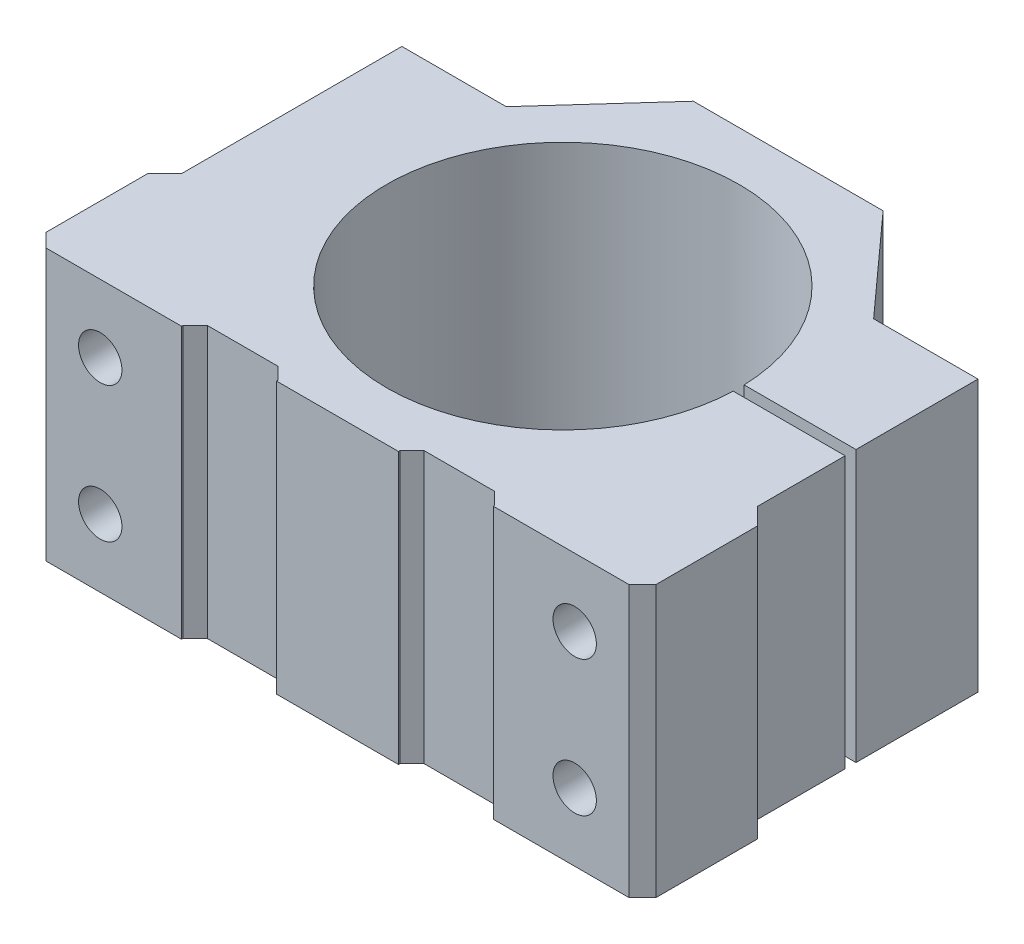
ISO-10303-21;
HEADER;
FILE_DESCRIPTION(('STEP AP214'),'2;1');
FILE_NAME('part.step','',(''),(''),'','','');
FILE_SCHEMA(('AUTOMOTIVE_DESIGN { 1 0 10303 214 1 1 1 1 }'));
ENDSEC;
DATA;
#1=APPLICATION_CONTEXT('core data for automotive mechanical design processes');
#2=APPLICATION_PROTOCOL_DEFINITION('international standard','automotive_design',2000,#1);
#3=PRODUCT_CONTEXT('',#1,'mechanical');
#4=PRODUCT('Part','Part','',(#3));
#5=PRODUCT_RELATED_PRODUCT_CATEGORY('part','',(#4));
#6=PRODUCT_DEFINITION_FORMATION('','',#4);
#7=PRODUCT_DEFINITION_CONTEXT('part definition',#1,'design');
#8=PRODUCT_DEFINITION('design','',#6,#7);
#9=PRODUCT_DEFINITION_SHAPE('','',#8);
#10=(LENGTH_UNIT() NAMED_UNIT(*) SI_UNIT(.MILLI.,.METRE.));
#11=(NAMED_UNIT(*) PLANE_ANGLE_UNIT() SI_UNIT($,.RADIAN.));
#12=(NAMED_UNIT(*) SI_UNIT($,.STERADIAN.) SOLID_ANGLE_UNIT());
#13=UNCERTAINTY_MEASURE_WITH_UNIT(LENGTH_MEASURE(1.E-05),#10,'distance_accuracy_value','');
#14=(GEOMETRIC_REPRESENTATION_CONTEXT(3) GLOBAL_UNCERTAINTY_ASSIGNED_CONTEXT((#13)) GLOBAL_UNIT_ASSIGNED_CONTEXT((#10,
#11,#12)) REPRESENTATION_CONTEXT('',''));
#15=CARTESIAN_POINT('',(0.,0.,0.));
#16=DIRECTION('',(0.,0.,1.));
#17=DIRECTION('',(1.,0.,0.));
#18=AXIS2_PLACEMENT_3D('',#15,#16,#17);
#19=CARTESIAN_POINT('',(42.5,40.,-18.75));
#20=DIRECTION('',(-1.,0.,0.));
#21=DIRECTION('',(0.,0.,1.));
#22=AXIS2_PLACEMENT_3D('',#19,#20,#21);
#23=PLANE('',#22);
#24=DIRECTION('',(0.,0.,-1.));
#25=VECTOR('',#24,1.);
#26=CARTESIAN_POINT('',(42.5,0.,-18.75));
#27=LINE('',#26,#25);
#28=CARTESIAN_POINT('',(42.5,0.,13.75));
#29=VERTEX_POINT('',#28);
#30=CARTESIAN_POINT('',(42.5,0.,0.849999999999967));
#31=VERTEX_POINT('',#30);
#32=EDGE_CURVE('E358',#29,#31,#27,.T.);
#33=ORIENTED_EDGE('',*,*,#32,.T.);
#34=DIRECTION('',(0.,-1.,0.));
#35=VECTOR('',#34,1.);
#36=CARTESIAN_POINT('',(42.5,0.,0.849999999999967));
#37=LINE('',#36,#35);
#38=CARTESIAN_POINT('',(42.5,40.,0.849999999999968));
#39=VERTEX_POINT('',#38);
#40=EDGE_CURVE('E490',#39,#31,#37,.T.);
#41=ORIENTED_EDGE('',*,*,#40,.F.);
#42=DIRECTION('',(0.,0.,-1.));
#43=VECTOR('',#42,1.);
#44=CARTESIAN_POINT('',(42.5,40.,-18.75));
#45=LINE('',#44,#43);
#46=CARTESIAN_POINT('',(42.5,40.,13.75));
#47=VERTEX_POINT('',#46);
#48=EDGE_CURVE('E304',#47,#39,#45,.T.);
#49=ORIENTED_EDGE('',*,*,#48,.F.);
#50=DIRECTION('',(0.,-1.,0.));
#51=VECTOR('',#50,1.);
#52=CARTESIAN_POINT('',(42.5,40.,13.75));
#53=LINE('',#52,#51);
#54=EDGE_CURVE('E382',#47,#29,#53,.T.);
#55=ORIENTED_EDGE('',*,*,#54,.T.);
#56=EDGE_LOOP('',(#33,#41,#49,#55));
#57=FACE_BOUND('',#56,.T.);
#58=ADVANCED_FACE('F32',(#57),#23,.F.);
#59=CARTESIAN_POINT('',(35.,30.,33.25));
#60=DIRECTION('',(0.,0.,-1.));
#61=DIRECTION('',(-1.,0.,0.));
#62=AXIS2_PLACEMENT_3D('',#59,#60,#61);
#63=CYLINDRICAL_SURFACE('',#62,3.2);
#64=CARTESIAN_POINT('',(35.,30.,0.849999999999969));
#65=DIRECTION('',(0.,0.,1.));
#66=DIRECTION('',(1.,0.,0.));
#67=AXIS2_PLACEMENT_3D('',#64,#65,#66);
#68=CIRCLE('',#67,3.2);
#69=CARTESIAN_POINT('',(38.2,30.,0.849999999999967));
#70=VERTEX_POINT('',#69);
#71=EDGE_CURVE('E503',#70,#70,#68,.T.);
#72=ORIENTED_EDGE('',*,*,#71,.F.);
#73=EDGE_LOOP('',(#72));
#74=FACE_BOUND('',#73,.T.);
#75=CARTESIAN_POINT('',(35.,30.,33.25));
#76=DIRECTION('',(0.,0.,-1.));
#77=DIRECTION('',(-1.,0.,0.));
#78=AXIS2_PLACEMENT_3D('',#75,#76,#77);
#79=CIRCLE('',#78,3.2);
#80=CARTESIAN_POINT('',(31.8,30.,33.25));
#81=VERTEX_POINT('',#80);
#82=EDGE_CURVE('E256',#81,#81,#79,.T.);
#83=ORIENTED_EDGE('',*,*,#82,.F.);
#84=EDGE_LOOP('',(#83));
#85=FACE_BOUND('',#84,.T.);
#86=ADVANCED_FACE('F527',(#74,#85),#63,.F.);
#87=CARTESIAN_POINT('',(35.,10.,33.25));
#88=DIRECTION('',(0.,0.,-1.));
#89=DIRECTION('',(-1.,0.,0.));
#90=AXIS2_PLACEMENT_3D('',#87,#88,#89);
#91=CYLINDRICAL_SURFACE('',#90,3.2);
#92=CARTESIAN_POINT('',(35.,10.,0.849999999999969));
#93=DIRECTION('',(0.,0.,1.));
#94=DIRECTION('',(1.,0.,0.));
#95=AXIS2_PLACEMENT_3D('',#92,#93,#94);
#96=CIRCLE('',#95,3.2);
#97=CARTESIAN_POINT('',(38.2,10.,0.849999999999967));
#98=VERTEX_POINT('',#97);
#99=EDGE_CURVE('E247',#98,#98,#96,.T.);
#100=ORIENTED_EDGE('',*,*,#99,.F.);
#101=EDGE_LOOP('',(#100));
#102=FACE_BOUND('',#101,.T.);
#103=CARTESIAN_POINT('',(35.,10.,33.25));
#104=DIRECTION('',(0.,0.,-1.));
#105=DIRECTION('',(-1.,0.,0.));
#106=AXIS2_PLACEMENT_3D('',#103,#104,#105);
#107=CIRCLE('',#106,3.2);
#108=CARTESIAN_POINT('',(31.8,10.,33.25));
#109=VERTEX_POINT('',#108);
#110=EDGE_CURVE('E507',#109,#109,#107,.T.);
#111=ORIENTED_EDGE('',*,*,#110,.F.);
#112=EDGE_LOOP('',(#111));
#113=FACE_BOUND('',#112,.T.);
#114=ADVANCED_FACE('F529',(#102,#113),#91,.F.);
#115=CARTESIAN_POINT('',(0.,40.,0.));
#116=DIRECTION('',(0.,-1.,0.));
#117=DIRECTION('',(0.,0.,-1.));
#118=AXIS2_PLACEMENT_3D('',#115,#116,#117);
#119=PLANE('',#118);
#120=ORIENTED_EDGE('',*,*,#48,.T.);
#121=DIRECTION('',(1.,0.,0.));
#122=VECTOR('',#121,1.);
#123=CARTESIAN_POINT('',(-45.001,40.,0.850000000000006));
#124=LINE('',#123,#122);
#125=CARTESIAN_POINT('',(25.9861020547523,40.,0.849999999999975));
#126=VERTEX_POINT('',#125);
#127=EDGE_CURVE('E498',#126,#39,#124,.T.);
#128=ORIENTED_EDGE('',*,*,#127,.F.);
#129=CARTESIAN_POINT('',(0.,40.,0.));
#130=DIRECTION('',(0.,1.,0.));
#131=DIRECTION('',(0.,0.,1.));
#132=AXIS2_PLACEMENT_3D('',#129,#130,#131);
#133=CIRCLE('',#132,26.);
#134=CARTESIAN_POINT('',(25.9891804410989,40.,-0.750000000000025));
#135=VERTEX_POINT('',#134);
#136=EDGE_CURVE('E250',#135,#126,#133,.T.);
#137=ORIENTED_EDGE('',*,*,#136,.F.);
#138=DIRECTION('',(1.,0.,0.));
#139=VECTOR('',#138,1.);
#140=CARTESIAN_POINT('',(-45.001,40.,-0.749999999999995));
#141=LINE('',#140,#139);
#142=CARTESIAN_POINT('',(42.5,40.,-0.750000000000033));
#143=VERTEX_POINT('',#142);
#144=EDGE_CURVE('E57',#135,#143,#141,.T.);
#145=ORIENTED_EDGE('',*,*,#144,.T.);
#146=CARTESIAN_POINT('',(42.5,40.,-18.75));
#147=VERTEX_POINT('',#146);
#148=EDGE_CURVE('E303',#143,#147,#45,.T.);
#149=ORIENTED_EDGE('',*,*,#148,.T.);
#150=DIRECTION('',(-1.,0.,0.));
#151=VECTOR('',#150,1.);
#152=CARTESIAN_POINT('',(42.5,40.,-18.75));
#153=LINE('',#152,#151);
#154=CARTESIAN_POINT('',(27.1,40.,-18.75));
#155=VERTEX_POINT('',#154);
#156=EDGE_CURVE('E307',#147,#155,#153,.T.);
#157=ORIENTED_EDGE('',*,*,#156,.T.);
#158=DIRECTION('',(-0.670377163466849,0.,-0.742020524448038));
#159=VECTOR('',#158,1.);
#160=CARTESIAN_POINT('',(27.1,40.,-18.75));
#161=LINE('',#160,#159);
#162=CARTESIAN_POINT('',(13.9999999999999,40.,-33.25));
#163=VERTEX_POINT('',#162);
#164=EDGE_CURVE('E309',#155,#163,#161,.T.);
#165=ORIENTED_EDGE('',*,*,#164,.T.);
#166=DIRECTION('',(-1.,0.,0.));
#167=VECTOR('',#166,1.);
#168=CARTESIAN_POINT('',(-14.,40.,-33.25));
#169=LINE('',#168,#167);
#170=CARTESIAN_POINT('',(-14.,40.,-33.25));
#171=VERTEX_POINT('',#170);
#172=EDGE_CURVE('E311',#163,#171,#169,.T.);
#173=ORIENTED_EDGE('',*,*,#172,.T.);
#174=DIRECTION('',(-0.670377163466849,0.,0.742020524448039));
#175=VECTOR('',#174,1.);
#176=CARTESIAN_POINT('',(-27.1,40.,-18.75));
#177=LINE('',#176,#175);
#178=CARTESIAN_POINT('',(-27.1,40.,-18.75));
#179=VERTEX_POINT('',#178);
#180=EDGE_CURVE('E313',#171,#179,#177,.T.);
#181=ORIENTED_EDGE('',*,*,#180,.T.);
#182=DIRECTION('',(-1.,0.,0.));
#183=VECTOR('',#182,1.);
#184=CARTESIAN_POINT('',(-42.5,40.,-18.75));
#185=LINE('',#184,#183);
#186=CARTESIAN_POINT('',(-42.5,40.,-18.75));
#187=VERTEX_POINT('',#186);
#188=EDGE_CURVE('E259',#179,#187,#185,.T.);
#189=ORIENTED_EDGE('',*,*,#188,.T.);
#190=DIRECTION('',(0.,0.,1.));
#191=VECTOR('',#190,1.);
#192=CARTESIAN_POINT('',(-42.5,40.,-18.75));
#193=LINE('',#192,#191);
#194=CARTESIAN_POINT('',(-42.5,40.,13.75));
#195=VERTEX_POINT('',#194);
#196=EDGE_CURVE('E262',#187,#195,#193,.T.);
#197=ORIENTED_EDGE('',*,*,#196,.T.);
#198=DIRECTION('',(-0.707106781186549,0.,0.707106781186545));
#199=VECTOR('',#198,1.);
#200=CARTESIAN_POINT('',(-42.5,40.,13.75));
#201=LINE('',#200,#199);
#202=CARTESIAN_POINT('',(-45.,40.,16.25));
#203=VERTEX_POINT('',#202);
#204=EDGE_CURVE('E265',#195,#203,#201,.T.);
#205=ORIENTED_EDGE('',*,*,#204,.T.);
#206=DIRECTION('',(0.,0.,1.));
#207=VECTOR('',#206,1.);
#208=CARTESIAN_POINT('',(-45.,40.,31.25));
#209=LINE('',#208,#207);
#210=CARTESIAN_POINT('',(-45.,40.,31.25));
#211=VERTEX_POINT('',#210);
#212=EDGE_CURVE('E267',#203,#211,#209,.T.);
#213=ORIENTED_EDGE('',*,*,#212,.T.);
#214=DIRECTION('',(0.707106781186547,0.,0.707106781186547));
#215=VECTOR('',#214,1.);
#216=CARTESIAN_POINT('',(-43.,40.,33.25));
#217=LINE('',#216,#215);
#218=CARTESIAN_POINT('',(-43.,40.,33.25));
#219=VERTEX_POINT('',#218);
#220=EDGE_CURVE('E269',#211,#219,#217,.T.);
#221=ORIENTED_EDGE('',*,*,#220,.T.);
#222=DIRECTION('',(1.,0.,0.));
#223=VECTOR('',#222,1.);
#224=CARTESIAN_POINT('',(-43.,40.,33.25));
#225=LINE('',#224,#223);
#226=CARTESIAN_POINT('',(-23.,40.,33.25));
#227=VERTEX_POINT('',#226);
#228=EDGE_CURVE('E271',#219,#227,#225,.T.);
#229=ORIENTED_EDGE('',*,*,#228,.T.);
#230=DIRECTION('',(0.,0.,-1.));
#231=VECTOR('',#230,1.);
#232=CARTESIAN_POINT('',(-23.,40.,33.25));
#233=LINE('',#232,#231);
#234=CARTESIAN_POINT('',(-23.,40.,33.05));
#235=VERTEX_POINT('',#234);
#236=EDGE_CURVE('E273',#227,#235,#233,.T.);
#237=ORIENTED_EDGE('',*,*,#236,.T.);
#238=DIRECTION('',(0.707106781186547,0.,-0.707106781186548));
#239=VECTOR('',#238,1.);
#240=CARTESIAN_POINT('',(-21.2,40.,31.25));
#241=LINE('',#240,#239);
#242=CARTESIAN_POINT('',(-21.2,40.,31.25));
#243=VERTEX_POINT('',#242);
#244=EDGE_CURVE('E275',#235,#243,#241,.T.);
#245=ORIENTED_EDGE('',*,*,#244,.T.);
#246=DIRECTION('',(1.,0.,0.));
#247=VECTOR('',#246,1.);
#248=CARTESIAN_POINT('',(-10.8,40.,31.25));
#249=LINE('',#248,#247);
#250=CARTESIAN_POINT('',(-10.8,40.,31.25));
#251=VERTEX_POINT('',#250);
#252=EDGE_CURVE('E277',#243,#251,#249,.T.);
#253=ORIENTED_EDGE('',*,*,#252,.T.);
#254=DIRECTION('',(0.707106781186547,0.,0.707106781186548));
#255=VECTOR('',#254,1.);
#256=CARTESIAN_POINT('',(-8.99999999999999,40.,33.05));
#257=LINE('',#256,#255);
#258=CARTESIAN_POINT('',(-8.99999999999999,40.,33.05));
#259=VERTEX_POINT('',#258);
#260=EDGE_CURVE('E279',#251,#259,#257,.T.);
#261=ORIENTED_EDGE('',*,*,#260,.T.);
#262=DIRECTION('',(0.,0.,1.));
#263=VECTOR('',#262,1.);
#264=CARTESIAN_POINT('',(-8.99999999999999,40.,33.25));
#265=LINE('',#264,#263);
#266=CARTESIAN_POINT('',(-8.99999999999999,40.,33.25));
#267=VERTEX_POINT('',#266);
#268=EDGE_CURVE('E281',#259,#267,#265,.T.);
#269=ORIENTED_EDGE('',*,*,#268,.T.);
#270=DIRECTION('',(1.,0.,0.));
#271=VECTOR('',#270,1.);
#272=CARTESIAN_POINT('',(8.99999999999999,40.,33.25));
#273=LINE('',#272,#271);
#274=CARTESIAN_POINT('',(8.99999999999999,40.,33.25));
#275=VERTEX_POINT('',#274);
#276=EDGE_CURVE('E283',#267,#275,#273,.T.);
#277=ORIENTED_EDGE('',*,*,#276,.T.);
#278=DIRECTION('',(0.,0.,-1.));
#279=VECTOR('',#278,1.);
#280=CARTESIAN_POINT('',(8.99999999999999,40.,33.05));
#281=LINE('',#280,#279);
#282=CARTESIAN_POINT('',(8.99999999999999,40.,33.05));
#283=VERTEX_POINT('',#282);
#284=EDGE_CURVE('E285',#275,#283,#281,.T.);
#285=ORIENTED_EDGE('',*,*,#284,.T.);
#286=DIRECTION('',(0.707106781186546,0.,-0.707106781186549));
#287=VECTOR('',#286,1.);
#288=CARTESIAN_POINT('',(8.99999999999999,40.,33.05));
#289=LINE('',#288,#287);
#290=CARTESIAN_POINT('',(10.8,40.,31.25));
#291=VERTEX_POINT('',#290);
#292=EDGE_CURVE('E287',#283,#291,#289,.T.);
#293=ORIENTED_EDGE('',*,*,#292,.T.);
#294=DIRECTION('',(1.,0.,0.));
#295=VECTOR('',#294,1.);
#296=CARTESIAN_POINT('',(10.8,40.,31.25));
#297=LINE('',#296,#295);
#298=CARTESIAN_POINT('',(21.2,40.,31.25));
#299=VERTEX_POINT('',#298);
#300=EDGE_CURVE('E289',#291,#299,#297,.T.);
#301=ORIENTED_EDGE('',*,*,#300,.T.);
#302=DIRECTION('',(0.707106781186547,0.,0.707106781186548));
#303=VECTOR('',#302,1.);
#304=CARTESIAN_POINT('',(21.2,40.,31.25));
#305=LINE('',#304,#303);
#306=CARTESIAN_POINT('',(23.,40.,33.05));
#307=VERTEX_POINT('',#306);
#308=EDGE_CURVE('E291',#299,#307,#305,.T.);
#309=ORIENTED_EDGE('',*,*,#308,.T.);
#310=DIRECTION('',(0.,0.,1.));
#311=VECTOR('',#310,1.);
#312=CARTESIAN_POINT('',(23.,40.,33.05));
#313=LINE('',#312,#311);
#314=CARTESIAN_POINT('',(23.,40.,33.25));
#315=VERTEX_POINT('',#314);
#316=EDGE_CURVE('E293',#307,#315,#313,.T.);
#317=ORIENTED_EDGE('',*,*,#316,.T.);
#318=DIRECTION('',(1.,0.,0.));
#319=VECTOR('',#318,1.);
#320=CARTESIAN_POINT('',(43.,40.,33.25));
#321=LINE('',#320,#319);
#322=CARTESIAN_POINT('',(43.,40.,33.25));
#323=VERTEX_POINT('',#322);
#324=EDGE_CURVE('E295',#315,#323,#321,.T.);
#325=ORIENTED_EDGE('',*,*,#324,.T.);
#326=DIRECTION('',(0.707106781186547,0.,-0.707106781186547));
#327=VECTOR('',#326,1.);
#328=CARTESIAN_POINT('',(43.,40.,33.25));
#329=LINE('',#328,#327);
#330=CARTESIAN_POINT('',(45.,40.,31.25));
#331=VERTEX_POINT('',#330);
#332=EDGE_CURVE('E297',#323,#331,#329,.T.);
#333=ORIENTED_EDGE('',*,*,#332,.T.);
#334=DIRECTION('',(0.,0.,-1.));
#335=VECTOR('',#334,1.);
#336=CARTESIAN_POINT('',(45.,40.,31.25));
#337=LINE('',#336,#335);
#338=CARTESIAN_POINT('',(45.,40.,16.25));
#339=VERTEX_POINT('',#338);
#340=EDGE_CURVE('E299',#331,#339,#337,.T.);
#341=ORIENTED_EDGE('',*,*,#340,.T.);
#342=DIRECTION('',(-0.707106781186551,0.,-0.707106781186544));
#343=VECTOR('',#342,1.);
#344=CARTESIAN_POINT('',(42.5,40.,13.75));
#345=LINE('',#344,#343);
#346=EDGE_CURVE('E301',#339,#47,#345,.T.);
#347=ORIENTED_EDGE('',*,*,#346,.T.);
#348=EDGE_LOOP('',(#120,#128,#137,#145,#149,#157,#165,#173,#181,#189,#197,#205,#213,#221,#229,
#237,#245,#253,#261,#269,#277,#285,#293,#301,#309,#317,#325,#333,#341,#347));
#349=FACE_BOUND('',#348,.T.);
#350=ADVANCED_FACE('F461',(#349),#119,.F.);
#351=CARTESIAN_POINT('',(0.,0.,0.));
#352=DIRECTION('',(0.,-1.,0.));
#353=DIRECTION('',(0.,0.,-1.));
#354=AXIS2_PLACEMENT_3D('',#351,#352,#353);
#355=PLANE('',#354);
#356=DIRECTION('',(1.,0.,0.));
#357=VECTOR('',#356,1.);
#358=CARTESIAN_POINT('',(-45.001,0.,0.850000000000005));
#359=LINE('',#358,#357);
#360=CARTESIAN_POINT('',(25.9861020547523,0.,0.849999999999974));
#361=VERTEX_POINT('',#360);
#362=EDGE_CURVE('E49',#361,#31,#359,.T.);
#363=ORIENTED_EDGE('',*,*,#362,.T.);
#364=ORIENTED_EDGE('',*,*,#32,.F.);
#365=DIRECTION('',(-0.707106781186551,0.,-0.707106781186544));
#366=VECTOR('',#365,1.);
#367=CARTESIAN_POINT('',(42.5,0.,13.75));
#368=LINE('',#367,#366);
#369=CARTESIAN_POINT('',(45.,0.,16.25));
#370=VERTEX_POINT('',#369);
#371=EDGE_CURVE('E356',#370,#29,#368,.T.);
#372=ORIENTED_EDGE('',*,*,#371,.F.);
#373=DIRECTION('',(0.,0.,-1.));
#374=VECTOR('',#373,1.);
#375=CARTESIAN_POINT('',(45.,0.,31.25));
#376=LINE('',#375,#374);
#377=CARTESIAN_POINT('',(45.,0.,31.25));
#378=VERTEX_POINT('',#377);
#379=EDGE_CURVE('E354',#378,#370,#376,.T.);
#380=ORIENTED_EDGE('',*,*,#379,.F.);
#381=DIRECTION('',(0.707106781186547,0.,-0.707106781186547));
#382=VECTOR('',#381,1.);
#383=CARTESIAN_POINT('',(43.,0.,33.25));
#384=LINE('',#383,#382);
#385=CARTESIAN_POINT('',(43.,0.,33.25));
#386=VERTEX_POINT('',#385);
#387=EDGE_CURVE('E352',#386,#378,#384,.T.);
#388=ORIENTED_EDGE('',*,*,#387,.F.);
#389=DIRECTION('',(1.,0.,0.));
#390=VECTOR('',#389,1.);
#391=CARTESIAN_POINT('',(43.,0.,33.25));
#392=LINE('',#391,#390);
#393=CARTESIAN_POINT('',(23.,0.,33.25));
#394=VERTEX_POINT('',#393);
#395=EDGE_CURVE('E350',#394,#386,#392,.T.);
#396=ORIENTED_EDGE('',*,*,#395,.F.);
#397=DIRECTION('',(0.,0.,1.));
#398=VECTOR('',#397,1.);
#399=CARTESIAN_POINT('',(23.,0.,33.05));
#400=LINE('',#399,#398);
#401=CARTESIAN_POINT('',(23.,0.,33.05));
#402=VERTEX_POINT('',#401);
#403=EDGE_CURVE('E348',#402,#394,#400,.T.);
#404=ORIENTED_EDGE('',*,*,#403,.F.);
#405=DIRECTION('',(0.707106781186547,0.,0.707106781186548));
#406=VECTOR('',#405,1.);
#407=CARTESIAN_POINT('',(21.2,0.,31.25));
#408=LINE('',#407,#406);
#409=CARTESIAN_POINT('',(21.2,0.,31.25));
#410=VERTEX_POINT('',#409);
#411=EDGE_CURVE('E346',#410,#402,#408,.T.);
#412=ORIENTED_EDGE('',*,*,#411,.F.);
#413=DIRECTION('',(1.,0.,0.));
#414=VECTOR('',#413,1.);
#415=CARTESIAN_POINT('',(10.8,0.,31.25));
#416=LINE('',#415,#414);
#417=CARTESIAN_POINT('',(10.8,0.,31.25));
#418=VERTEX_POINT('',#417);
#419=EDGE_CURVE('E344',#418,#410,#416,.T.);
#420=ORIENTED_EDGE('',*,*,#419,.F.);
#421=DIRECTION('',(0.707106781186546,0.,-0.707106781186549));
#422=VECTOR('',#421,1.);
#423=CARTESIAN_POINT('',(8.99999999999999,0.,33.05));
#424=LINE('',#423,#422);
#425=CARTESIAN_POINT('',(8.99999999999999,0.,33.05));
#426=VERTEX_POINT('',#425);
#427=EDGE_CURVE('E342',#426,#418,#424,.T.);
#428=ORIENTED_EDGE('',*,*,#427,.F.);
#429=DIRECTION('',(0.,0.,-1.));
#430=VECTOR('',#429,1.);
#431=CARTESIAN_POINT('',(8.99999999999999,0.,33.05));
#432=LINE('',#431,#430);
#433=CARTESIAN_POINT('',(8.99999999999999,0.,33.25));
#434=VERTEX_POINT('',#433);
#435=EDGE_CURVE('E340',#434,#426,#432,.T.);
#436=ORIENTED_EDGE('',*,*,#435,.F.);
#437=DIRECTION('',(1.,0.,0.));
#438=VECTOR('',#437,1.);
#439=CARTESIAN_POINT('',(8.99999999999999,0.,33.25));
#440=LINE('',#439,#438);
#441=CARTESIAN_POINT('',(-8.99999999999999,0.,33.25));
#442=VERTEX_POINT('',#441);
#443=EDGE_CURVE('E338',#442,#434,#440,.T.);
#444=ORIENTED_EDGE('',*,*,#443,.F.);
#445=DIRECTION('',(0.,0.,1.));
#446=VECTOR('',#445,1.);
#447=CARTESIAN_POINT('',(-8.99999999999999,0.,33.25));
#448=LINE('',#447,#446);
#449=CARTESIAN_POINT('',(-8.99999999999999,0.,33.05));
#450=VERTEX_POINT('',#449);
#451=EDGE_CURVE('E336',#450,#442,#448,.T.);
#452=ORIENTED_EDGE('',*,*,#451,.F.);
#453=DIRECTION('',(0.707106781186547,0.,0.707106781186548));
#454=VECTOR('',#453,1.);
#455=CARTESIAN_POINT('',(-8.99999999999999,0.,33.05));
#456=LINE('',#455,#454);
#457=CARTESIAN_POINT('',(-10.8,0.,31.25));
#458=VERTEX_POINT('',#457);
#459=EDGE_CURVE('E334',#458,#450,#456,.T.);
#460=ORIENTED_EDGE('',*,*,#459,.F.);
#461=DIRECTION('',(1.,0.,0.));
#462=VECTOR('',#461,1.);
#463=CARTESIAN_POINT('',(-10.8,0.,31.25));
#464=LINE('',#463,#462);
#465=CARTESIAN_POINT('',(-21.2,0.,31.25));
#466=VERTEX_POINT('',#465);
#467=EDGE_CURVE('E332',#466,#458,#464,.T.);
#468=ORIENTED_EDGE('',*,*,#467,.F.);
#469=DIRECTION('',(0.707106781186547,0.,-0.707106781186548));
#470=VECTOR('',#469,1.);
#471=CARTESIAN_POINT('',(-21.2,0.,31.25));
#472=LINE('',#471,#470);
#473=CARTESIAN_POINT('',(-23.,0.,33.05));
#474=VERTEX_POINT('',#473);
#475=EDGE_CURVE('E330',#474,#466,#472,.T.);
#476=ORIENTED_EDGE('',*,*,#475,.F.);
#477=DIRECTION('',(0.,0.,-1.));
#478=VECTOR('',#477,1.);
#479=CARTESIAN_POINT('',(-23.,0.,33.25));
#480=LINE('',#479,#478);
#481=CARTESIAN_POINT('',(-23.,0.,33.25));
#482=VERTEX_POINT('',#481);
#483=EDGE_CURVE('E328',#482,#474,#480,.T.);
#484=ORIENTED_EDGE('',*,*,#483,.F.);
#485=DIRECTION('',(1.,0.,0.));
#486=VECTOR('',#485,1.);
#487=CARTESIAN_POINT('',(-43.,0.,33.25));
#488=LINE('',#487,#486);
#489=CARTESIAN_POINT('',(-43.,0.,33.25));
#490=VERTEX_POINT('',#489);
#491=EDGE_CURVE('E326',#490,#482,#488,.T.);
#492=ORIENTED_EDGE('',*,*,#491,.F.);
#493=DIRECTION('',(0.707106781186547,0.,0.707106781186547));
#494=VECTOR('',#493,1.);
#495=CARTESIAN_POINT('',(-43.,0.,33.25));
#496=LINE('',#495,#494);
#497=CARTESIAN_POINT('',(-45.,0.,31.25));
#498=VERTEX_POINT('',#497);
#499=EDGE_CURVE('E324',#498,#490,#496,.T.);
#500=ORIENTED_EDGE('',*,*,#499,.F.);
#501=DIRECTION('',(0.,0.,1.));
#502=VECTOR('',#501,1.);
#503=CARTESIAN_POINT('',(-45.,0.,31.25));
#504=LINE('',#503,#502);
#505=CARTESIAN_POINT('',(-45.,0.,16.25));
#506=VERTEX_POINT('',#505);
#507=EDGE_CURVE('E322',#506,#498,#504,.T.);
#508=ORIENTED_EDGE('',*,*,#507,.F.);
#509=DIRECTION('',(-0.707106781186549,0.,0.707106781186545));
#510=VECTOR('',#509,1.);
#511=CARTESIAN_POINT('',(-42.5,0.,13.75));
#512=LINE('',#511,#510);
#513=CARTESIAN_POINT('',(-42.5,0.,13.75));
#514=VERTEX_POINT('',#513);
#515=EDGE_CURVE('E320',#514,#506,#512,.T.);
#516=ORIENTED_EDGE('',*,*,#515,.F.);
#517=DIRECTION('',(0.,0.,1.));
#518=VECTOR('',#517,1.);
#519=CARTESIAN_POINT('',(-42.5,0.,-18.75));
#520=LINE('',#519,#518);
#521=CARTESIAN_POINT('',(-42.5,0.,-18.75));
#522=VERTEX_POINT('',#521);
#523=EDGE_CURVE('E318',#522,#514,#520,.T.);
#524=ORIENTED_EDGE('',*,*,#523,.F.);
#525=DIRECTION('',(-1.,0.,0.));
#526=VECTOR('',#525,1.);
#527=CARTESIAN_POINT('',(-42.5,0.,-18.75));
#528=LINE('',#527,#526);
#529=CARTESIAN_POINT('',(-27.1,0.,-18.75));
#530=VERTEX_POINT('',#529);
#531=EDGE_CURVE('E253',#530,#522,#528,.T.);
#532=ORIENTED_EDGE('',*,*,#531,.F.);
#533=DIRECTION('',(-0.670377163466849,0.,0.742020524448039));
#534=VECTOR('',#533,1.);
#535=CARTESIAN_POINT('',(-27.1,0.,-18.75));
#536=LINE('',#535,#534);
#537=CARTESIAN_POINT('',(-14.,0.,-33.25));
#538=VERTEX_POINT('',#537);
#539=EDGE_CURVE('E263',#538,#530,#536,.T.);
#540=ORIENTED_EDGE('',*,*,#539,.F.);
#541=DIRECTION('',(-1.,0.,0.));
#542=VECTOR('',#541,1.);
#543=CARTESIAN_POINT('',(-14.,0.,-33.25));
#544=LINE('',#543,#542);
#545=CARTESIAN_POINT('',(13.9999999999999,0.,-33.25));
#546=VERTEX_POINT('',#545);
#547=EDGE_CURVE('E365',#546,#538,#544,.T.);
#548=ORIENTED_EDGE('',*,*,#547,.F.);
#549=DIRECTION('',(-0.670377163466849,0.,-0.742020524448038));
#550=VECTOR('',#549,1.);
#551=CARTESIAN_POINT('',(27.1,0.,-18.75));
#552=LINE('',#551,#550);
#553=CARTESIAN_POINT('',(27.1,0.,-18.75));
#554=VERTEX_POINT('',#553);
#555=EDGE_CURVE('E363',#554,#546,#552,.T.);
#556=ORIENTED_EDGE('',*,*,#555,.F.);
#557=DIRECTION('',(-1.,0.,0.));
#558=VECTOR('',#557,1.);
#559=CARTESIAN_POINT('',(42.5,0.,-18.75));
#560=LINE('',#559,#558);
#561=CARTESIAN_POINT('',(42.5,0.,-18.75));
#562=VERTEX_POINT('',#561);
#563=EDGE_CURVE('E361',#562,#554,#560,.T.);
#564=ORIENTED_EDGE('',*,*,#563,.F.);
#565=CARTESIAN_POINT('',(42.5,0.,-0.750000000000033));
#566=VERTEX_POINT('',#565);
#567=EDGE_CURVE('E246',#566,#562,#27,.T.);
#568=ORIENTED_EDGE('',*,*,#567,.F.);
#569=DIRECTION('',(1.,0.,0.));
#570=VECTOR('',#569,1.);
#571=CARTESIAN_POINT('',(-45.001,0.,-0.749999999999995));
#572=LINE('',#571,#570);
#573=CARTESIAN_POINT('',(25.9891804410989,0.,-0.750000000000026));
#574=VERTEX_POINT('',#573);
#575=EDGE_CURVE('E231',#574,#566,#572,.T.);
#576=ORIENTED_EDGE('',*,*,#575,.F.);
#577=CARTESIAN_POINT('',(0.,0.,0.));
#578=DIRECTION('',(0.,1.,0.));
#579=DIRECTION('',(0.,0.,1.));
#580=AXIS2_PLACEMENT_3D('',#577,#578,#579);
#581=CIRCLE('',#580,26.);
#582=EDGE_CURVE('E244',#574,#361,#581,.T.);
#583=ORIENTED_EDGE('',*,*,#582,.T.);
#584=EDGE_LOOP('',(#363,#364,#372,#380,#388,#396,#404,#412,#420,#428,#436,#444,#452,#460,#468,
#476,#484,#492,#500,#508,#516,#524,#532,#540,#548,#556,#564,#568,#576,#583));
#585=FACE_BOUND('',#584,.T.);
#586=ADVANCED_FACE('F243',(#585),#355,.T.);
#587=CARTESIAN_POINT('',(-42.5,40.,-18.75));
#588=DIRECTION('',(0.,0.,1.));
#589=DIRECTION('',(1.,0.,0.));
#590=AXIS2_PLACEMENT_3D('',#587,#588,#589);
#591=PLANE('',#590);
#592=CARTESIAN_POINT('',(-35.,9.99999999999998,-18.75));
#593=DIRECTION('',(0.,0.,1.));
#594=DIRECTION('',(1.,0.,0.));
#595=AXIS2_PLACEMENT_3D('',#592,#593,#594);
#596=CIRCLE('',#595,3.19999999999999);
#597=CARTESIAN_POINT('',(-31.8,9.99999999999998,-18.75));
#598=VERTEX_POINT('',#597);
#599=EDGE_CURVE('E519',#598,#598,#596,.T.);
#600=ORIENTED_EDGE('',*,*,#599,.T.);
#601=EDGE_LOOP('',(#600));
#602=FACE_BOUND('',#601,.T.);
#603=CARTESIAN_POINT('',(-35.,30.,-18.75));
#604=DIRECTION('',(0.,0.,1.));
#605=DIRECTION('',(1.,0.,0.));
#606=AXIS2_PLACEMENT_3D('',#603,#604,#605);
#607=CIRCLE('',#606,3.20000000000002);
#608=CARTESIAN_POINT('',(-31.8,30.,-18.75));
#609=VERTEX_POINT('',#608);
#610=EDGE_CURVE('E516',#609,#609,#607,.T.);
#611=ORIENTED_EDGE('',*,*,#610,.T.);
#612=EDGE_LOOP('',(#611));
#613=FACE_BOUND('',#612,.T.);
#614=ORIENTED_EDGE('',*,*,#531,.T.);
#615=DIRECTION('',(0.,-1.,0.));
#616=VECTOR('',#615,1.);
#617=CARTESIAN_POINT('',(-42.5,40.,-18.75));
#618=LINE('',#617,#616);
#619=EDGE_CURVE('E11',#187,#522,#618,.T.);
#620=ORIENTED_EDGE('',*,*,#619,.F.);
#621=ORIENTED_EDGE('',*,*,#188,.F.);
#622=DIRECTION('',(0.,-1.,0.));
#623=VECTOR('',#622,1.);
#624=CARTESIAN_POINT('',(-27.1,40.,-18.75));
#625=LINE('',#624,#623);
#626=EDGE_CURVE('E315',#179,#530,#625,.T.);
#627=ORIENTED_EDGE('',*,*,#626,.T.);
#628=EDGE_LOOP('',(#614,#620,#621,#627));
#629=FACE_BOUND('',#628,.T.);
#630=ADVANCED_FACE('F34',(#602,#613,#629),#591,.F.);
#631=CARTESIAN_POINT('',(-42.5,40.,-18.75));
#632=DIRECTION('',(1.,0.,0.));
#633=DIRECTION('',(0.,0.,-1.));
#634=AXIS2_PLACEMENT_3D('',#631,#632,#633);
#635=PLANE('',#634);
#636=ORIENTED_EDGE('',*,*,#523,.T.);
#637=DIRECTION('',(0.,-1.,0.));
#638=VECTOR('',#637,1.);
#639=CARTESIAN_POINT('',(-42.5,40.,13.75));
#640=LINE('',#639,#638);
#641=EDGE_CURVE('E41',#195,#514,#640,.T.);
#642=ORIENTED_EDGE('',*,*,#641,.F.);
#643=ORIENTED_EDGE('',*,*,#196,.F.);
#644=ORIENTED_EDGE('',*,*,#619,.T.);
#645=EDGE_LOOP('',(#636,#642,#643,#644));
#646=FACE_BOUND('',#645,.T.);
#647=ADVANCED_FACE('F465',(#646),#635,.F.);
#648=CARTESIAN_POINT('',(-42.5,40.,13.75));
#649=DIRECTION('',(0.707106781186546,0.,0.70710678118655));
#650=DIRECTION('',(0.70710678118655,0.,-0.707106781186546));
#651=AXIS2_PLACEMENT_3D('',#648,#649,#650);
#652=PLANE('',#651);
#653=ORIENTED_EDGE('',*,*,#515,.T.);
#654=DIRECTION('',(0.,-1.,0.));
#655=VECTOR('',#654,1.);
#656=CARTESIAN_POINT('',(-45.,40.,16.25));
#657=LINE('',#656,#655);
#658=EDGE_CURVE('E436',#203,#506,#657,.T.);
#659=ORIENTED_EDGE('',*,*,#658,.F.);
#660=ORIENTED_EDGE('',*,*,#204,.F.);
#661=ORIENTED_EDGE('',*,*,#641,.T.);
#662=EDGE_LOOP('',(#653,#659,#660,#661));
#663=FACE_BOUND('',#662,.T.);
#664=ADVANCED_FACE('F444',(#663),#652,.F.);
#665=CARTESIAN_POINT('',(-45.,40.,31.25));
#666=DIRECTION('',(1.,0.,0.));
#667=DIRECTION('',(0.,0.,-1.));
#668=AXIS2_PLACEMENT_3D('',#665,#666,#667);
#669=PLANE('',#668);
#670=ORIENTED_EDGE('',*,*,#507,.T.);
#671=DIRECTION('',(0.,-1.,0.));
#672=VECTOR('',#671,1.);
#673=CARTESIAN_POINT('',(-45.,40.,31.25));
#674=LINE('',#673,#672);
#675=EDGE_CURVE('E433',#211,#498,#674,.T.);
#676=ORIENTED_EDGE('',*,*,#675,.F.);
#677=ORIENTED_EDGE('',*,*,#212,.F.);
#678=ORIENTED_EDGE('',*,*,#658,.T.);
#679=EDGE_LOOP('',(#670,#676,#677,#678));
#680=FACE_BOUND('',#679,.T.);
#681=ADVANCED_FACE('F453',(#680),#669,.F.);
#682=CARTESIAN_POINT('',(-43.,40.,33.25));
#683=DIRECTION('',(0.707106781186548,0.,-0.707106781186548));
#684=DIRECTION('',(-0.707106781186548,0.,-0.707106781186548));
#685=AXIS2_PLACEMENT_3D('',#682,#683,#684);
#686=PLANE('',#685);
#687=ORIENTED_EDGE('',*,*,#499,.T.);
#688=DIRECTION('',(0.,-1.,0.));
#689=VECTOR('',#688,1.);
#690=CARTESIAN_POINT('',(-43.,40.,33.25));
#691=LINE('',#690,#689);
#692=EDGE_CURVE('E430',#219,#490,#691,.T.);
#693=ORIENTED_EDGE('',*,*,#692,.F.);
#694=ORIENTED_EDGE('',*,*,#220,.F.);
#695=ORIENTED_EDGE('',*,*,#675,.T.);
#696=EDGE_LOOP('',(#687,#693,#694,#695));
#697=FACE_BOUND('',#696,.T.);
#698=ADVANCED_FACE('F457',(#697),#686,.F.);
#699=CARTESIAN_POINT('',(-43.,40.,33.25));
#700=DIRECTION('',(0.,0.,-1.));
#701=DIRECTION('',(-1.,0.,0.));
#702=AXIS2_PLACEMENT_3D('',#699,#700,#701);
#703=PLANE('',#702);
#704=CARTESIAN_POINT('',(-35.,9.99999999999998,33.25));
#705=DIRECTION('',(0.,0.,-1.));
#706=DIRECTION('',(1.,0.,0.));
#707=AXIS2_PLACEMENT_3D('',#704,#705,#706);
#708=CIRCLE('',#707,3.19999999999999);
#709=CARTESIAN_POINT('',(-31.8,9.99999999999998,33.25));
#710=VERTEX_POINT('',#709);
#711=EDGE_CURVE('E510',#710,#710,#708,.T.);
#712=ORIENTED_EDGE('',*,*,#711,.T.);
#713=EDGE_LOOP('',(#712));
#714=FACE_BOUND('',#713,.T.);
#715=CARTESIAN_POINT('',(-35.,30.,33.25));
#716=DIRECTION('',(0.,0.,-1.));
#717=DIRECTION('',(1.,0.,0.));
#718=AXIS2_PLACEMENT_3D('',#715,#716,#717);
#719=CIRCLE('',#718,3.20000000000002);
#720=CARTESIAN_POINT('',(-31.8,30.,33.25));
#721=VERTEX_POINT('',#720);
#722=EDGE_CURVE('E513',#721,#721,#719,.T.);
#723=ORIENTED_EDGE('',*,*,#722,.T.);
#724=EDGE_LOOP('',(#723));
#725=FACE_BOUND('',#724,.T.);
#726=ORIENTED_EDGE('',*,*,#491,.T.);
#727=DIRECTION('',(0.,-1.,0.));
#728=VECTOR('',#727,1.);
#729=CARTESIAN_POINT('',(-23.,40.,33.25));
#730=LINE('',#729,#728);
#731=EDGE_CURVE('E427',#227,#482,#730,.T.);
#732=ORIENTED_EDGE('',*,*,#731,.F.);
#733=ORIENTED_EDGE('',*,*,#228,.F.);
#734=ORIENTED_EDGE('',*,*,#692,.T.);
#735=EDGE_LOOP('',(#726,#732,#733,#734));
#736=FACE_BOUND('',#735,.T.);
#737=ADVANCED_FACE('F627',(#714,#725,#736),#703,.F.);
#738=CARTESIAN_POINT('',(-23.,40.,33.25));
#739=DIRECTION('',(-1.,0.,0.));
#740=DIRECTION('',(0.,0.,1.));
#741=AXIS2_PLACEMENT_3D('',#738,#739,#740);
#742=PLANE('',#741);
#743=ORIENTED_EDGE('',*,*,#483,.T.);
#744=DIRECTION('',(0.,-1.,0.));
#745=VECTOR('',#744,1.);
#746=CARTESIAN_POINT('',(-23.,40.,33.05));
#747=LINE('',#746,#745);
#748=EDGE_CURVE('E424',#235,#474,#747,.T.);
#749=ORIENTED_EDGE('',*,*,#748,.F.);
#750=ORIENTED_EDGE('',*,*,#236,.F.);
#751=ORIENTED_EDGE('',*,*,#731,.T.);
#752=EDGE_LOOP('',(#743,#749,#750,#751));
#753=FACE_BOUND('',#752,.T.);
#754=ADVANCED_FACE('F623',(#753),#742,.F.);
#755=CARTESIAN_POINT('',(-21.2,40.,31.25));
#756=DIRECTION('',(-0.707106781186548,0.,-0.707106781186547));
#757=DIRECTION('',(-0.707106781186547,0.,0.707106781186548));
#758=AXIS2_PLACEMENT_3D('',#755,#756,#757);
#759=PLANE('',#758);
#760=ORIENTED_EDGE('',*,*,#475,.T.);
#761=DIRECTION('',(0.,-1.,0.));
#762=VECTOR('',#761,1.);
#763=CARTESIAN_POINT('',(-21.2,40.,31.25));
#764=LINE('',#763,#762);
#765=EDGE_CURVE('E421',#243,#466,#764,.T.);
#766=ORIENTED_EDGE('',*,*,#765,.F.);
#767=ORIENTED_EDGE('',*,*,#244,.F.);
#768=ORIENTED_EDGE('',*,*,#748,.T.);
#769=EDGE_LOOP('',(#760,#766,#767,#768));
#770=FACE_BOUND('',#769,.T.);
#771=ADVANCED_FACE('F619',(#770),#759,.F.);
#772=CARTESIAN_POINT('',(-10.8,40.,31.25));
#773=DIRECTION('',(0.,0.,-1.));
#774=DIRECTION('',(-1.,0.,0.));
#775=AXIS2_PLACEMENT_3D('',#772,#773,#774);
#776=PLANE('',#775);
#777=ORIENTED_EDGE('',*,*,#467,.T.);
#778=DIRECTION('',(0.,-1.,0.));
#779=VECTOR('',#778,1.);
#780=CARTESIAN_POINT('',(-10.8,40.,31.25));
#781=LINE('',#780,#779);
#782=EDGE_CURVE('E418',#251,#458,#781,.T.);
#783=ORIENTED_EDGE('',*,*,#782,.F.);
#784=ORIENTED_EDGE('',*,*,#252,.F.);
#785=ORIENTED_EDGE('',*,*,#765,.T.);
#786=EDGE_LOOP('',(#777,#783,#784,#785));
#787=FACE_BOUND('',#786,.T.);
#788=ADVANCED_FACE('F615',(#787),#776,.F.);
#789=CARTESIAN_POINT('',(-8.99999999999999,40.,33.05));
#790=DIRECTION('',(0.707106781186548,0.,-0.707106781186547));
#791=DIRECTION('',(-0.707106781186547,0.,-0.707106781186548));
#792=AXIS2_PLACEMENT_3D('',#789,#790,#791);
#793=PLANE('',#792);
#794=ORIENTED_EDGE('',*,*,#459,.T.);
#795=DIRECTION('',(0.,-1.,0.));
#796=VECTOR('',#795,1.);
#797=CARTESIAN_POINT('',(-8.99999999999999,40.,33.05));
#798=LINE('',#797,#796);
#799=EDGE_CURVE('E415',#259,#450,#798,.T.);
#800=ORIENTED_EDGE('',*,*,#799,.F.);
#801=ORIENTED_EDGE('',*,*,#260,.F.);
#802=ORIENTED_EDGE('',*,*,#782,.T.);
#803=EDGE_LOOP('',(#794,#800,#801,#802));
#804=FACE_BOUND('',#803,.T.);
#805=ADVANCED_FACE('F611',(#804),#793,.F.);
#806=CARTESIAN_POINT('',(-8.99999999999999,40.,33.25));
#807=DIRECTION('',(1.,0.,0.));
#808=DIRECTION('',(0.,0.,-1.));
#809=AXIS2_PLACEMENT_3D('',#806,#807,#808);
#810=PLANE('',#809);
#811=ORIENTED_EDGE('',*,*,#451,.T.);
#812=DIRECTION('',(0.,-1.,0.));
#813=VECTOR('',#812,1.);
#814=CARTESIAN_POINT('',(-8.99999999999999,40.,33.25));
#815=LINE('',#814,#813);
#816=EDGE_CURVE('E412',#267,#442,#815,.T.);
#817=ORIENTED_EDGE('',*,*,#816,.F.);
#818=ORIENTED_EDGE('',*,*,#268,.F.);
#819=ORIENTED_EDGE('',*,*,#799,.T.);
#820=EDGE_LOOP('',(#811,#817,#818,#819));
#821=FACE_BOUND('',#820,.T.);
#822=ADVANCED_FACE('F607',(#821),#810,.F.);
#823=CARTESIAN_POINT('',(8.99999999999999,40.,33.25));
#824=DIRECTION('',(0.,0.,-1.));
#825=DIRECTION('',(-1.,0.,0.));
#826=AXIS2_PLACEMENT_3D('',#823,#824,#825);
#827=PLANE('',#826);
#828=ORIENTED_EDGE('',*,*,#443,.T.);
#829=DIRECTION('',(0.,-1.,0.));
#830=VECTOR('',#829,1.);
#831=CARTESIAN_POINT('',(8.99999999999999,40.,33.25));
#832=LINE('',#831,#830);
#833=EDGE_CURVE('E409',#275,#434,#832,.T.);
#834=ORIENTED_EDGE('',*,*,#833,.F.);
#835=ORIENTED_EDGE('',*,*,#276,.F.);
#836=ORIENTED_EDGE('',*,*,#816,.T.);
#837=EDGE_LOOP('',(#828,#834,#835,#836));
#838=FACE_BOUND('',#837,.T.);
#839=ADVANCED_FACE('F603',(#838),#827,.F.);
#840=CARTESIAN_POINT('',(8.99999999999999,40.,33.05));
#841=DIRECTION('',(-1.,0.,0.));
#842=DIRECTION('',(0.,0.,1.));
#843=AXIS2_PLACEMENT_3D('',#840,#841,#842);
#844=PLANE('',#843);
#845=ORIENTED_EDGE('',*,*,#435,.T.);
#846=DIRECTION('',(0.,-1.,0.));
#847=VECTOR('',#846,1.);
#848=CARTESIAN_POINT('',(8.99999999999999,40.,33.05));
#849=LINE('',#848,#847);
#850=EDGE_CURVE('E406',#283,#426,#849,.T.);
#851=ORIENTED_EDGE('',*,*,#850,.F.);
#852=ORIENTED_EDGE('',*,*,#284,.F.);
#853=ORIENTED_EDGE('',*,*,#833,.T.);
#854=EDGE_LOOP('',(#845,#851,#852,#853));
#855=FACE_BOUND('',#854,.T.);
#856=ADVANCED_FACE('F599',(#855),#844,.F.);
#857=CARTESIAN_POINT('',(8.99999999999999,40.,33.05));
#858=DIRECTION('',(-0.707106781186549,0.,-0.707106781186546));
#859=DIRECTION('',(-0.707106781186546,0.,0.707106781186549));
#860=AXIS2_PLACEMENT_3D('',#857,#858,#859);
#861=PLANE('',#860);
#862=ORIENTED_EDGE('',*,*,#427,.T.);
#863=DIRECTION('',(0.,-1.,0.));
#864=VECTOR('',#863,1.);
#865=CARTESIAN_POINT('',(10.8,40.,31.25));
#866=LINE('',#865,#864);
#867=EDGE_CURVE('E403',#291,#418,#866,.T.);
#868=ORIENTED_EDGE('',*,*,#867,.F.);
#869=ORIENTED_EDGE('',*,*,#292,.F.);
#870=ORIENTED_EDGE('',*,*,#850,.T.);
#871=EDGE_LOOP('',(#862,#868,#869,#870));
#872=FACE_BOUND('',#871,.T.);
#873=ADVANCED_FACE('F595',(#872),#861,.F.);
#874=CARTESIAN_POINT('',(10.8,40.,31.25));
#875=DIRECTION('',(0.,0.,-1.));
#876=DIRECTION('',(-1.,0.,0.));
#877=AXIS2_PLACEMENT_3D('',#874,#875,#876);
#878=PLANE('',#877);
#879=ORIENTED_EDGE('',*,*,#419,.T.);
#880=DIRECTION('',(0.,-1.,0.));
#881=VECTOR('',#880,1.);
#882=CARTESIAN_POINT('',(21.2,40.,31.25));
#883=LINE('',#882,#881);
#884=EDGE_CURVE('E400',#299,#410,#883,.T.);
#885=ORIENTED_EDGE('',*,*,#884,.F.);
#886=ORIENTED_EDGE('',*,*,#300,.F.);
#887=ORIENTED_EDGE('',*,*,#867,.T.);
#888=EDGE_LOOP('',(#879,#885,#886,#887));
#889=FACE_BOUND('',#888,.T.);
#890=ADVANCED_FACE('F591',(#889),#878,.F.);
#891=CARTESIAN_POINT('',(21.2,40.,31.25));
#892=DIRECTION('',(0.707106781186548,0.,-0.707106781186547));
#893=DIRECTION('',(-0.707106781186547,0.,-0.707106781186548));
#894=AXIS2_PLACEMENT_3D('',#891,#892,#893);
#895=PLANE('',#894);
#896=ORIENTED_EDGE('',*,*,#411,.T.);
#897=DIRECTION('',(0.,-1.,0.));
#898=VECTOR('',#897,1.);
#899=CARTESIAN_POINT('',(23.,40.,33.05));
#900=LINE('',#899,#898);
#901=EDGE_CURVE('E397',#307,#402,#900,.T.);
#902=ORIENTED_EDGE('',*,*,#901,.F.);
#903=ORIENTED_EDGE('',*,*,#308,.F.);
#904=ORIENTED_EDGE('',*,*,#884,.T.);
#905=EDGE_LOOP('',(#896,#902,#903,#904));
#906=FACE_BOUND('',#905,.T.);
#907=ADVANCED_FACE('F587',(#906),#895,.F.);
#908=CARTESIAN_POINT('',(23.,40.,33.05));
#909=DIRECTION('',(1.,0.,0.));
#910=DIRECTION('',(0.,0.,-1.));
#911=AXIS2_PLACEMENT_3D('',#908,#909,#910);
#912=PLANE('',#911);
#913=ORIENTED_EDGE('',*,*,#403,.T.);
#914=DIRECTION('',(0.,-1.,0.));
#915=VECTOR('',#914,1.);
#916=CARTESIAN_POINT('',(23.,40.,33.25));
#917=LINE('',#916,#915);
#918=EDGE_CURVE('E394',#315,#394,#917,.T.);
#919=ORIENTED_EDGE('',*,*,#918,.F.);
#920=ORIENTED_EDGE('',*,*,#316,.F.);
#921=ORIENTED_EDGE('',*,*,#901,.T.);
#922=EDGE_LOOP('',(#913,#919,#920,#921));
#923=FACE_BOUND('',#922,.T.);
#924=ADVANCED_FACE('F583',(#923),#912,.F.);
#925=CARTESIAN_POINT('',(43.,40.,33.25));
#926=DIRECTION('',(0.,0.,-1.));
#927=DIRECTION('',(-1.,0.,0.));
#928=AXIS2_PLACEMENT_3D('',#925,#926,#927);
#929=PLANE('',#928);
#930=ORIENTED_EDGE('',*,*,#110,.T.);
#931=EDGE_LOOP('',(#930));
#932=FACE_BOUND('',#931,.T.);
#933=ORIENTED_EDGE('',*,*,#82,.T.);
#934=EDGE_LOOP('',(#933));
#935=FACE_BOUND('',#934,.T.);
#936=ORIENTED_EDGE('',*,*,#395,.T.);
#937=DIRECTION('',(0.,-1.,0.));
#938=VECTOR('',#937,1.);
#939=CARTESIAN_POINT('',(43.,40.,33.25));
#940=LINE('',#939,#938);
#941=EDGE_CURVE('E391',#323,#386,#940,.T.);
#942=ORIENTED_EDGE('',*,*,#941,.F.);
#943=ORIENTED_EDGE('',*,*,#324,.F.);
#944=ORIENTED_EDGE('',*,*,#918,.T.);
#945=EDGE_LOOP('',(#936,#942,#943,#944));
#946=FACE_BOUND('',#945,.T.);
#947=ADVANCED_FACE('F524',(#932,#935,#946),#929,.F.);
#948=CARTESIAN_POINT('',(43.,40.,33.25));
#949=DIRECTION('',(-0.707106781186548,0.,-0.707106781186548));
#950=DIRECTION('',(-0.707106781186548,0.,0.707106781186548));
#951=AXIS2_PLACEMENT_3D('',#948,#949,#950);
#952=PLANE('',#951);
#953=ORIENTED_EDGE('',*,*,#387,.T.);
#954=DIRECTION('',(0.,-1.,0.));
#955=VECTOR('',#954,1.);
#956=CARTESIAN_POINT('',(45.,40.,31.25));
#957=LINE('',#956,#955);
#958=EDGE_CURVE('E388',#331,#378,#957,.T.);
#959=ORIENTED_EDGE('',*,*,#958,.F.);
#960=ORIENTED_EDGE('',*,*,#332,.F.);
#961=ORIENTED_EDGE('',*,*,#941,.T.);
#962=EDGE_LOOP('',(#953,#959,#960,#961));
#963=FACE_BOUND('',#962,.T.);
#964=ADVANCED_FACE('F576',(#963),#952,.F.);
#965=CARTESIAN_POINT('',(45.,40.,31.25));
#966=DIRECTION('',(-1.,0.,0.));
#967=DIRECTION('',(0.,0.,1.));
#968=AXIS2_PLACEMENT_3D('',#965,#966,#967);
#969=PLANE('',#968);
#970=ORIENTED_EDGE('',*,*,#379,.T.);
#971=DIRECTION('',(0.,-1.,0.));
#972=VECTOR('',#971,1.);
#973=CARTESIAN_POINT('',(45.,40.,16.25));
#974=LINE('',#973,#972);
#975=EDGE_CURVE('E385',#339,#370,#974,.T.);
#976=ORIENTED_EDGE('',*,*,#975,.F.);
#977=ORIENTED_EDGE('',*,*,#340,.F.);
#978=ORIENTED_EDGE('',*,*,#958,.T.);
#979=EDGE_LOOP('',(#970,#976,#977,#978));
#980=FACE_BOUND('',#979,.T.);
#981=ADVANCED_FACE('F572',(#980),#969,.F.);
#982=CARTESIAN_POINT('',(42.5,40.,13.75));
#983=DIRECTION('',(-0.707106781186544,0.,0.707106781186551));
#984=DIRECTION('',(0.707106781186551,0.,0.707106781186544));
#985=AXIS2_PLACEMENT_3D('',#982,#983,#984);
#986=PLANE('',#985);
#987=ORIENTED_EDGE('',*,*,#371,.T.);
#988=ORIENTED_EDGE('',*,*,#54,.F.);
#989=ORIENTED_EDGE('',*,*,#346,.F.);
#990=ORIENTED_EDGE('',*,*,#975,.T.);
#991=EDGE_LOOP('',(#987,#988,#989,#990));
#992=FACE_BOUND('',#991,.T.);
#993=ADVANCED_FACE('F566',(#992),#986,.F.);
#994=ORIENTED_EDGE('',*,*,#148,.F.);
#995=DIRECTION('',(0.,1.,0.));
#996=VECTOR('',#995,1.);
#997=CARTESIAN_POINT('',(42.5,0.,-0.750000000000033));
#998=LINE('',#997,#996);
#999=EDGE_CURVE('E237',#566,#143,#998,.T.);
#1000=ORIENTED_EDGE('',*,*,#999,.F.);
#1001=ORIENTED_EDGE('',*,*,#567,.T.);
#1002=DIRECTION('',(0.,-1.,0.));
#1003=VECTOR('',#1002,1.);
#1004=CARTESIAN_POINT('',(42.5,40.,-18.75));
#1005=LINE('',#1004,#1003);
#1006=EDGE_CURVE('E379',#147,#562,#1005,.T.);
#1007=ORIENTED_EDGE('',*,*,#1006,.F.);
#1008=EDGE_LOOP('',(#994,#1000,#1001,#1007));
#1009=FACE_BOUND('',#1008,.T.);
#1010=ADVANCED_FACE('F489',(#1009),#23,.F.);
#1011=CARTESIAN_POINT('',(42.5,40.,-18.75));
#1012=DIRECTION('',(0.,0.,1.));
#1013=DIRECTION('',(1.,0.,0.));
#1014=AXIS2_PLACEMENT_3D('',#1011,#1012,#1013);
#1015=PLANE('',#1014);
#1016=CARTESIAN_POINT('',(35.,10.,-18.75));
#1017=DIRECTION('',(0.,0.,1.));
#1018=DIRECTION('',(1.,0.,0.));
#1019=AXIS2_PLACEMENT_3D('',#1016,#1017,#1018);
#1020=CIRCLE('',#1019,3.2);
#1021=CARTESIAN_POINT('',(38.2,10.,-18.75));
#1022=VERTEX_POINT('',#1021);
#1023=EDGE_CURVE('E36',#1022,#1022,#1020,.T.);
#1024=ORIENTED_EDGE('',*,*,#1023,.T.);
#1025=EDGE_LOOP('',(#1024));
#1026=FACE_BOUND('',#1025,.T.);
#1027=CARTESIAN_POINT('',(35.,30.,-18.75));
#1028=DIRECTION('',(0.,0.,1.));
#1029=DIRECTION('',(1.,0.,0.));
#1030=AXIS2_PLACEMENT_3D('',#1027,#1028,#1029);
#1031=CIRCLE('',#1030,3.2);
#1032=CARTESIAN_POINT('',(38.2,30.,-18.75));
#1033=VERTEX_POINT('',#1032);
#1034=EDGE_CURVE('E251',#1033,#1033,#1031,.T.);
#1035=ORIENTED_EDGE('',*,*,#1034,.T.);
#1036=EDGE_LOOP('',(#1035));
#1037=FACE_BOUND('',#1036,.T.);
#1038=ORIENTED_EDGE('',*,*,#563,.T.);
#1039=DIRECTION('',(0.,-1.,0.));
#1040=VECTOR('',#1039,1.);
#1041=CARTESIAN_POINT('',(27.1,40.,-18.75));
#1042=LINE('',#1041,#1040);
#1043=EDGE_CURVE('E376',#155,#554,#1042,.T.);
#1044=ORIENTED_EDGE('',*,*,#1043,.F.);
#1045=ORIENTED_EDGE('',*,*,#156,.F.);
#1046=ORIENTED_EDGE('',*,*,#1006,.T.);
#1047=EDGE_LOOP('',(#1038,#1044,#1045,#1046));
#1048=FACE_BOUND('',#1047,.T.);
#1049=ADVANCED_FACE('F484',(#1026,#1037,#1048),#1015,.F.);
#1050=CARTESIAN_POINT('',(27.1,40.,-18.75));
#1051=DIRECTION('',(-0.742020524448038,0.,0.670377163466849));
#1052=DIRECTION('',(0.670377163466849,0.,0.742020524448038));
#1053=AXIS2_PLACEMENT_3D('',#1050,#1051,#1052);
#1054=PLANE('',#1053);
#1055=ORIENTED_EDGE('',*,*,#555,.T.);
#1056=DIRECTION('',(0.,-1.,0.));
#1057=VECTOR('',#1056,1.);
#1058=CARTESIAN_POINT('',(13.9999999999999,40.,-33.25));
#1059=LINE('',#1058,#1057);
#1060=EDGE_CURVE('E373',#163,#546,#1059,.T.);
#1061=ORIENTED_EDGE('',*,*,#1060,.F.);
#1062=ORIENTED_EDGE('',*,*,#164,.F.);
#1063=ORIENTED_EDGE('',*,*,#1043,.T.);
#1064=EDGE_LOOP('',(#1055,#1061,#1062,#1063));
#1065=FACE_BOUND('',#1064,.T.);
#1066=ADVANCED_FACE('F481',(#1065),#1054,.F.);
#1067=CARTESIAN_POINT('',(-14.,40.,-33.25));
#1068=DIRECTION('',(0.,0.,1.));
#1069=DIRECTION('',(1.,0.,0.));
#1070=AXIS2_PLACEMENT_3D('',#1067,#1068,#1069);
#1071=PLANE('',#1070);
#1072=ORIENTED_EDGE('',*,*,#547,.T.);
#1073=DIRECTION('',(0.,-1.,0.));
#1074=VECTOR('',#1073,1.);
#1075=CARTESIAN_POINT('',(-14.,40.,-33.25));
#1076=LINE('',#1075,#1074);
#1077=EDGE_CURVE('E370',#171,#538,#1076,.T.);
#1078=ORIENTED_EDGE('',*,*,#1077,.F.);
#1079=ORIENTED_EDGE('',*,*,#172,.F.);
#1080=ORIENTED_EDGE('',*,*,#1060,.T.);
#1081=EDGE_LOOP('',(#1072,#1078,#1079,#1080));
#1082=FACE_BOUND('',#1081,.T.);
#1083=ADVANCED_FACE('F477',(#1082),#1071,.F.);
#1084=CARTESIAN_POINT('',(-27.1,40.,-18.75));
#1085=DIRECTION('',(0.742020524448039,0.,0.670377163466849));
#1086=DIRECTION('',(0.670377163466849,0.,-0.742020524448039));
#1087=AXIS2_PLACEMENT_3D('',#1084,#1085,#1086);
#1088=PLANE('',#1087);
#1089=ORIENTED_EDGE('',*,*,#539,.T.);
#1090=ORIENTED_EDGE('',*,*,#626,.F.);
#1091=ORIENTED_EDGE('',*,*,#180,.F.);
#1092=ORIENTED_EDGE('',*,*,#1077,.T.);
#1093=EDGE_LOOP('',(#1089,#1090,#1091,#1092));
#1094=FACE_BOUND('',#1093,.T.);
#1095=ADVANCED_FACE('F472',(#1094),#1088,.F.);
#1096=CARTESIAN_POINT('',(0.,40.,0.));
#1097=DIRECTION('',(0.,-1.,0.));
#1098=DIRECTION('',(0.,0.,-1.));
#1099=AXIS2_PLACEMENT_3D('',#1096,#1097,#1098);
#1100=CYLINDRICAL_SURFACE('',#1099,26.);
#1101=DIRECTION('',(0.,-1.,0.));
#1102=VECTOR('',#1101,1.);
#1103=CARTESIAN_POINT('',(25.9861020547523,40.,0.849999999999975));
#1104=LINE('',#1103,#1102);
#1105=EDGE_CURVE('E238',#126,#361,#1104,.T.);
#1106=ORIENTED_EDGE('',*,*,#1105,.T.);
#1107=ORIENTED_EDGE('',*,*,#582,.F.);
#1108=DIRECTION('',(0.,-1.,0.));
#1109=VECTOR('',#1108,1.);
#1110=CARTESIAN_POINT('',(25.9891804410989,40.,-0.750000000000025));
#1111=LINE('',#1110,#1109);
#1112=EDGE_CURVE('E228',#574,#135,#1111,.F.);
#1113=ORIENTED_EDGE('',*,*,#1112,.T.);
#1114=ORIENTED_EDGE('',*,*,#136,.T.);
#1115=EDGE_LOOP('',(#1106,#1107,#1113,#1114));
#1116=FACE_BOUND('',#1115,.T.);
#1117=ADVANCED_FACE('F249',(#1116),#1100,.F.);
#1118=CARTESIAN_POINT('',(35.,30.,-0.750000000000028));
#1119=DIRECTION('',(0.,0.,-1.));
#1120=DIRECTION('',(-1.,0.,0.));
#1121=AXIS2_PLACEMENT_3D('',#1118,#1119,#1120);
#1122=CIRCLE('',#1121,3.2);
#1123=CARTESIAN_POINT('',(31.8,30.,-0.750000000000027));
#1124=VERTEX_POINT('',#1123);
#1125=EDGE_CURVE('E494',#1124,#1124,#1122,.T.);
#1126=ORIENTED_EDGE('',*,*,#1125,.F.);
#1127=EDGE_LOOP('',(#1126));
#1128=FACE_BOUND('',#1127,.T.);
#1129=ORIENTED_EDGE('',*,*,#1034,.F.);
#1130=EDGE_LOOP('',(#1129));
#1131=FACE_BOUND('',#1130,.T.);
#1132=ADVANCED_FACE('F532',(#1128,#1131),#63,.F.);
#1133=CARTESIAN_POINT('',(35.,10.,-0.750000000000028));
#1134=DIRECTION('',(0.,0.,-1.));
#1135=DIRECTION('',(-1.,0.,0.));
#1136=AXIS2_PLACEMENT_3D('',#1133,#1134,#1135);
#1137=CIRCLE('',#1136,3.2);
#1138=CARTESIAN_POINT('',(31.8,10.,-0.750000000000027));
#1139=VERTEX_POINT('',#1138);
#1140=EDGE_CURVE('E506',#1139,#1139,#1137,.T.);
#1141=ORIENTED_EDGE('',*,*,#1140,.F.);
#1142=EDGE_LOOP('',(#1141));
#1143=FACE_BOUND('',#1142,.T.);
#1144=ORIENTED_EDGE('',*,*,#1023,.F.);
#1145=EDGE_LOOP('',(#1144));
#1146=FACE_BOUND('',#1145,.T.);
#1147=ADVANCED_FACE('F539',(#1143,#1146),#91,.F.);
#1148=CARTESIAN_POINT('',(-35.,30.,33.25));
#1149=DIRECTION('',(0.,0.,-1.));
#1150=DIRECTION('',(-1.,0.,0.));
#1151=AXIS2_PLACEMENT_3D('',#1148,#1149,#1150);
#1152=CYLINDRICAL_SURFACE('',#1151,3.20000000000002);
#1153=ORIENTED_EDGE('',*,*,#722,.F.);
#1154=EDGE_LOOP('',(#1153));
#1155=FACE_BOUND('',#1154,.T.);
#1156=ORIENTED_EDGE('',*,*,#610,.F.);
#1157=EDGE_LOOP('',(#1156));
#1158=FACE_BOUND('',#1157,.T.);
#1159=ADVANCED_FACE('F551',(#1155,#1158),#1152,.F.);
#1160=CARTESIAN_POINT('',(-35.,9.99999999999998,33.25));
#1161=DIRECTION('',(0.,0.,-1.));
#1162=DIRECTION('',(-1.,0.,0.));
#1163=AXIS2_PLACEMENT_3D('',#1160,#1161,#1162);
#1164=CYLINDRICAL_SURFACE('',#1163,3.19999999999999);
#1165=ORIENTED_EDGE('',*,*,#711,.F.);
#1166=EDGE_LOOP('',(#1165));
#1167=FACE_BOUND('',#1166,.T.);
#1168=ORIENTED_EDGE('',*,*,#599,.F.);
#1169=EDGE_LOOP('',(#1168));
#1170=FACE_BOUND('',#1169,.T.);
#1171=ADVANCED_FACE('F651',(#1167,#1170),#1164,.F.);
#1172=CARTESIAN_POINT('',(-45.001,0.,-0.749999999999995));
#1173=DIRECTION('',(0.,0.,-1.));
#1174=DIRECTION('',(-1.,0.,0.));
#1175=AXIS2_PLACEMENT_3D('',#1172,#1173,#1174);
#1176=PLANE('',#1175);
#1177=ORIENTED_EDGE('',*,*,#1125,.T.);
#1178=EDGE_LOOP('',(#1177));
#1179=FACE_BOUND('',#1178,.T.);
#1180=ORIENTED_EDGE('',*,*,#1140,.T.);
#1181=EDGE_LOOP('',(#1180));
#1182=FACE_BOUND('',#1181,.T.);
#1183=ORIENTED_EDGE('',*,*,#575,.T.);
#1184=ORIENTED_EDGE('',*,*,#999,.T.);
#1185=ORIENTED_EDGE('',*,*,#144,.F.);
#1186=ORIENTED_EDGE('',*,*,#1112,.F.);
#1187=EDGE_LOOP('',(#1183,#1184,#1185,#1186));
#1188=FACE_BOUND('',#1187,.T.);
#1189=ADVANCED_FACE('F230',(#1179,#1182,#1188),#1176,.F.);
#1190=CARTESIAN_POINT('',(-45.001,0.,0.850000000000005));
#1191=DIRECTION('',(0.,0.,1.));
#1192=DIRECTION('',(1.,0.,0.));
#1193=AXIS2_PLACEMENT_3D('',#1190,#1191,#1192);
#1194=PLANE('',#1193);
#1195=ORIENTED_EDGE('',*,*,#99,.T.);
#1196=EDGE_LOOP('',(#1195));
#1197=FACE_BOUND('',#1196,.T.);
#1198=ORIENTED_EDGE('',*,*,#71,.T.);
#1199=EDGE_LOOP('',(#1198));
#1200=FACE_BOUND('',#1199,.T.);
#1201=ORIENTED_EDGE('',*,*,#127,.T.);
#1202=ORIENTED_EDGE('',*,*,#40,.T.);
#1203=ORIENTED_EDGE('',*,*,#362,.F.);
#1204=ORIENTED_EDGE('',*,*,#1105,.F.);
#1205=EDGE_LOOP('',(#1201,#1202,#1203,#1204));
#1206=FACE_BOUND('',#1205,.T.);
#1207=ADVANCED_FACE('F662',(#1197,#1200,#1206),#1194,.F.);
#1208=CLOSED_SHELL('',(#58,#86,#114,#350,#586,#630,#647,#664,#681,#698,#737,#754,#771,#788,#805,
#822,#839,#856,#873,#890,#907,#924,#947,#964,#981,#993,#1010,#1049,#1066,#1083,#1095,#1117,
#1132,#1147,#1159,#1171,#1189,#1207));
#1209=MANIFOLD_SOLID_BREP('B2',#1208);
#1210=ADVANCED_BREP_SHAPE_REPRESENTATION('',(#18,#1209),#14);
#1211=SHAPE_DEFINITION_REPRESENTATION(#9,#1210);
ENDSEC;
END-ISO-10303-21;
